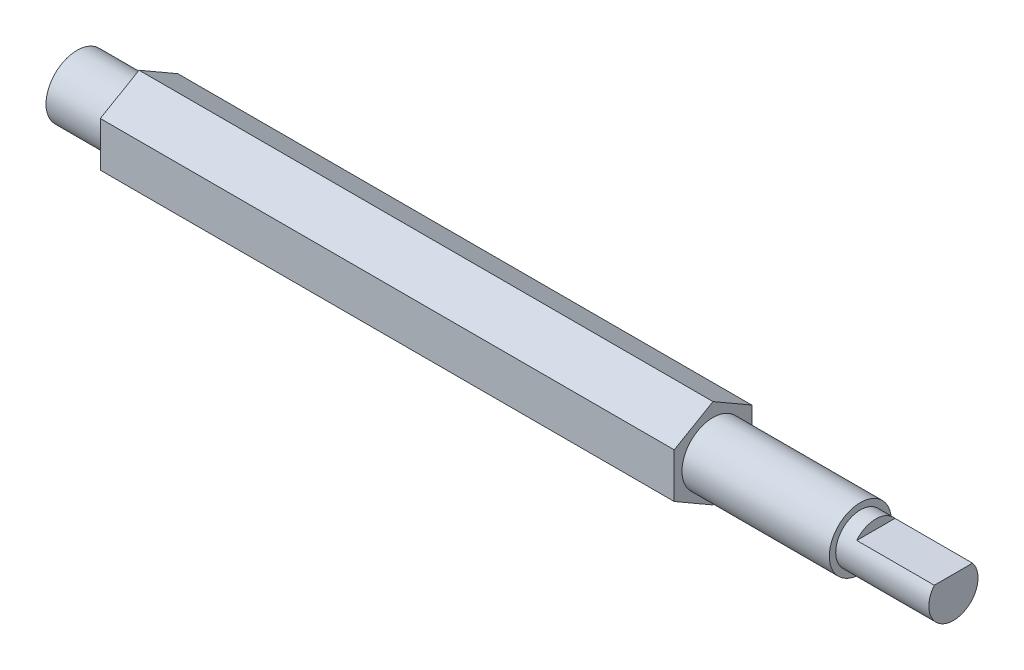
ISO-10303-21;
HEADER;
FILE_DESCRIPTION(('STEP AP214'),'2;1');
FILE_NAME('part.step','',(''),(''),'','','');
FILE_SCHEMA(('AUTOMOTIVE_DESIGN { 1 0 10303 214 1 1 1 1 }'));
ENDSEC;
DATA;
#1=APPLICATION_CONTEXT('core data for automotive mechanical design processes');
#2=APPLICATION_PROTOCOL_DEFINITION('international standard','automotive_design',2000,#1);
#3=PRODUCT_CONTEXT('',#1,'mechanical');
#4=PRODUCT('Part','Part','',(#3));
#5=PRODUCT_RELATED_PRODUCT_CATEGORY('part','',(#4));
#6=PRODUCT_DEFINITION_FORMATION('','',#4);
#7=PRODUCT_DEFINITION_CONTEXT('part definition',#1,'design');
#8=PRODUCT_DEFINITION('design','',#6,#7);
#9=PRODUCT_DEFINITION_SHAPE('','',#8);
#10=(LENGTH_UNIT() NAMED_UNIT(*) SI_UNIT(.MILLI.,.METRE.));
#11=(NAMED_UNIT(*) PLANE_ANGLE_UNIT() SI_UNIT($,.RADIAN.));
#12=(NAMED_UNIT(*) SI_UNIT($,.STERADIAN.) SOLID_ANGLE_UNIT());
#13=UNCERTAINTY_MEASURE_WITH_UNIT(LENGTH_MEASURE(1.E-05),#10,'distance_accuracy_value','');
#14=(GEOMETRIC_REPRESENTATION_CONTEXT(3) GLOBAL_UNCERTAINTY_ASSIGNED_CONTEXT((#13)) GLOBAL_UNIT_ASSIGNED_CONTEXT((#10,
#11,#12)) REPRESENTATION_CONTEXT('',''));
#15=CARTESIAN_POINT('',(0.,0.,0.));
#16=DIRECTION('',(0.,0.,1.));
#17=DIRECTION('',(1.,0.,0.));
#18=AXIS2_PLACEMENT_3D('',#15,#16,#17);
#19=CARTESIAN_POINT('',(36.9999999999998,2.,0.));
#20=DIRECTION('',(-1.,0.,0.));
#21=DIRECTION('',(0.,0.,1.));
#22=AXIS2_PLACEMENT_3D('',#19,#20,#21);
#23=PLANE('',#22);
#24=DIRECTION('',(0.,-0.5,-0.866025403784439));
#25=VECTOR('',#24,1.);
#26=CARTESIAN_POINT('',(36.9999999999998,1.44337567297406,-2.5));
#27=LINE('',#26,#25);
#28=CARTESIAN_POINT('',(36.9999999999998,2.88675134594813,0.));
#29=VERTEX_POINT('',#28);
#30=CARTESIAN_POINT('',(36.9999999999998,1.44337567297406,-2.5));
#31=VERTEX_POINT('',#30);
#32=EDGE_CURVE('E131',#29,#31,#27,.T.);
#33=ORIENTED_EDGE('',*,*,#32,.F.);
#34=DIRECTION('',(0.,0.5,-0.866025403784439));
#35=VECTOR('',#34,1.);
#36=CARTESIAN_POINT('',(36.9999999999998,2.88675134594813,0.));
#37=LINE('',#36,#35);
#38=CARTESIAN_POINT('',(36.9999999999998,1.44337567297406,2.5));
#39=VERTEX_POINT('',#38);
#40=EDGE_CURVE('E129',#39,#29,#37,.T.);
#41=ORIENTED_EDGE('',*,*,#40,.F.);
#42=DIRECTION('',(0.,1.,0.));
#43=VECTOR('',#42,1.);
#44=CARTESIAN_POINT('',(36.9999999999998,1.44337567297406,2.5));
#45=LINE('',#44,#43);
#46=CARTESIAN_POINT('',(36.9999999999998,-1.44337567297406,2.5));
#47=VERTEX_POINT('',#46);
#48=EDGE_CURVE('E61',#47,#39,#45,.T.);
#49=ORIENTED_EDGE('',*,*,#48,.F.);
#50=DIRECTION('',(0.,0.5,0.866025403784439));
#51=VECTOR('',#50,1.);
#52=CARTESIAN_POINT('',(36.9999999999998,-1.44337567297406,2.5));
#53=LINE('',#52,#51);
#54=CARTESIAN_POINT('',(36.9999999999998,-2.88675134594813,0.));
#55=VERTEX_POINT('',#54);
#56=EDGE_CURVE('E125',#55,#47,#53,.T.);
#57=ORIENTED_EDGE('',*,*,#56,.F.);
#58=DIRECTION('',(0.,-0.5,0.866025403784439));
#59=VECTOR('',#58,1.);
#60=CARTESIAN_POINT('',(36.9999999999998,-2.88675134594813,0.));
#61=LINE('',#60,#59);
#62=CARTESIAN_POINT('',(36.9999999999998,-1.44337567297406,-2.5));
#63=VERTEX_POINT('',#62);
#64=EDGE_CURVE('E123',#63,#55,#61,.T.);
#65=ORIENTED_EDGE('',*,*,#64,.F.);
#66=DIRECTION('',(0.,-1.,0.));
#67=VECTOR('',#66,1.);
#68=CARTESIAN_POINT('',(36.9999999999998,-1.44337567297406,-2.5));
#69=LINE('',#68,#67);
#70=EDGE_CURVE('E126',#31,#63,#69,.T.);
#71=ORIENTED_EDGE('',*,*,#70,.F.);
#72=EDGE_LOOP('',(#33,#41,#49,#57,#65,#71));
#73=FACE_BOUND('',#72,.T.);
#74=CARTESIAN_POINT('',(36.9999999999998,0.,0.));
#75=DIRECTION('',(-1.,0.,0.));
#76=DIRECTION('',(0.,0.,1.));
#77=AXIS2_PLACEMENT_3D('',#74,#75,#76);
#78=CIRCLE('',#77,2.);
#79=CARTESIAN_POINT('',(36.9999999999998,0.,2.));
#80=VERTEX_POINT('',#79);
#81=EDGE_CURVE('E178',#80,#80,#78,.T.);
#82=ORIENTED_EDGE('',*,*,#81,.T.);
#83=EDGE_LOOP('',(#82));
#84=FACE_BOUND('',#83,.T.);
#85=ADVANCED_FACE('F38',(#73,#84),#23,.F.);
#86=CARTESIAN_POINT('',(-6.18518518518519,0.,0.));
#87=DIRECTION('',(-1.,0.,0.));
#88=DIRECTION('',(0.,0.,1.));
#89=AXIS2_PLACEMENT_3D('',#86,#87,#88);
#90=CYLINDRICAL_SURFACE('',#89,2.);
#91=ORIENTED_EDGE('',*,*,#81,.F.);
#92=EDGE_LOOP('',(#91));
#93=FACE_BOUND('',#92,.T.);
#94=CARTESIAN_POINT('',(46.4999999999998,0.,0.));
#95=DIRECTION('',(-1.,0.,0.));
#96=DIRECTION('',(0.,0.,1.));
#97=AXIS2_PLACEMENT_3D('',#94,#95,#96);
#98=CIRCLE('',#97,2.);
#99=CARTESIAN_POINT('',(46.4999999999998,0.,2.));
#100=VERTEX_POINT('',#99);
#101=EDGE_CURVE('E175',#100,#100,#98,.T.);
#102=ORIENTED_EDGE('',*,*,#101,.T.);
#103=EDGE_LOOP('',(#102));
#104=FACE_BOUND('',#103,.T.);
#105=ADVANCED_FACE('F197',(#93,#104),#90,.T.);
#106=CARTESIAN_POINT('',(46.4999999999998,2.,0.));
#107=DIRECTION('',(-1.,0.,0.));
#108=DIRECTION('',(0.,0.,1.));
#109=AXIS2_PLACEMENT_3D('',#106,#107,#108);
#110=PLANE('',#109);
#111=ORIENTED_EDGE('',*,*,#101,.F.);
#112=EDGE_LOOP('',(#111));
#113=FACE_BOUND('',#112,.T.);
#114=CARTESIAN_POINT('',(46.4999999999998,0.,0.));
#115=DIRECTION('',(-1.,0.,0.));
#116=DIRECTION('',(0.,0.,1.));
#117=AXIS2_PLACEMENT_3D('',#114,#115,#116);
#118=CIRCLE('',#117,1.5875);
#119=CARTESIAN_POINT('',(46.4999999999998,0.,1.5875));
#120=VERTEX_POINT('',#119);
#121=EDGE_CURVE('E172',#120,#120,#118,.T.);
#122=ORIENTED_EDGE('',*,*,#121,.T.);
#123=EDGE_LOOP('',(#122));
#124=FACE_BOUND('',#123,.T.);
#125=ADVANCED_FACE('F192',(#113,#124),#110,.F.);
#126=CARTESIAN_POINT('',(-6.18518518518519,0.,0.));
#127=DIRECTION('',(-1.,0.,0.));
#128=DIRECTION('',(0.,0.,1.));
#129=AXIS2_PLACEMENT_3D('',#126,#127,#128);
#130=CYLINDRICAL_SURFACE('',#129,1.5875);
#131=ORIENTED_EDGE('',*,*,#121,.F.);
#132=EDGE_LOOP('',(#131));
#133=FACE_BOUND('',#132,.T.);
#134=CARTESIAN_POINT('',(52.4999999999998,0.,0.));
#135=DIRECTION('',(-1.,0.,0.));
#136=DIRECTION('',(0.,0.,1.));
#137=AXIS2_PLACEMENT_3D('',#134,#135,#136);
#138=CIRCLE('',#137,1.5875);
#139=CARTESIAN_POINT('',(52.4999999999998,1.,-1.23294616670802));
#140=VERTEX_POINT('',#139);
#141=CARTESIAN_POINT('',(52.4999999999998,1.,1.23294616670802));
#142=VERTEX_POINT('',#141);
#143=EDGE_CURVE('E116',#140,#142,#138,.T.);
#144=ORIENTED_EDGE('',*,*,#143,.T.);
#145=DIRECTION('',(-1.,0.,0.));
#146=VECTOR('',#145,1.);
#147=CARTESIAN_POINT('',(-6.18518518518519,1.,1.23294616670802));
#148=LINE('',#147,#146);
#149=CARTESIAN_POINT('',(47.4999999999998,1.,1.23294616670802));
#150=VERTEX_POINT('',#149);
#151=EDGE_CURVE('E53',#142,#150,#148,.T.);
#152=ORIENTED_EDGE('',*,*,#151,.T.);
#153=CARTESIAN_POINT('',(47.4999999999998,0.,0.));
#154=DIRECTION('',(1.,0.,0.));
#155=DIRECTION('',(0.,0.,-1.));
#156=AXIS2_PLACEMENT_3D('',#153,#154,#155);
#157=CIRCLE('',#156,1.5875);
#158=CARTESIAN_POINT('',(47.4999999999998,1.,-1.23294616670802));
#159=VERTEX_POINT('',#158);
#160=EDGE_CURVE('E11',#159,#150,#157,.T.);
#161=ORIENTED_EDGE('',*,*,#160,.F.);
#162=DIRECTION('',(-1.,0.,0.));
#163=VECTOR('',#162,1.);
#164=CARTESIAN_POINT('',(-6.18518518518519,1.,-1.23294616670802));
#165=LINE('',#164,#163);
#166=EDGE_CURVE('E103',#159,#140,#165,.F.);
#167=ORIENTED_EDGE('',*,*,#166,.T.);
#168=EDGE_LOOP('',(#144,#152,#161,#167));
#169=FACE_BOUND('',#168,.T.);
#170=ADVANCED_FACE('F115',(#133,#169),#130,.T.);
#171=CARTESIAN_POINT('',(52.4999999999998,1.5875,0.));
#172=DIRECTION('',(-1.,0.,0.));
#173=DIRECTION('',(0.,0.,1.));
#174=AXIS2_PLACEMENT_3D('',#171,#172,#173);
#175=PLANE('',#174);
#176=ORIENTED_EDGE('',*,*,#143,.F.);
#177=DIRECTION('',(0.,0.,1.));
#178=VECTOR('',#177,1.);
#179=CARTESIAN_POINT('',(52.4999999999998,1.,0.));
#180=LINE('',#179,#178);
#181=EDGE_CURVE('E46',#140,#142,#180,.T.);
#182=ORIENTED_EDGE('',*,*,#181,.T.);
#183=EDGE_LOOP('',(#176,#182));
#184=FACE_BOUND('',#183,.T.);
#185=ADVANCED_FACE('F181',(#184),#175,.F.);
#186=CARTESIAN_POINT('',(44.6376261582595,-1.44337567297406,-2.5));
#187=DIRECTION('',(0.,0.,1.));
#188=DIRECTION('',(1.,0.,0.));
#189=AXIS2_PLACEMENT_3D('',#186,#187,#188);
#190=PLANE('',#189);
#191=ORIENTED_EDGE('',*,*,#70,.T.);
#192=DIRECTION('',(-1.,0.,0.));
#193=VECTOR('',#192,1.);
#194=CARTESIAN_POINT('',(44.6376261582595,-1.44337567297406,-2.5));
#195=LINE('',#194,#193);
#196=CARTESIAN_POINT('',(0.,-1.44337567297406,-2.5));
#197=VERTEX_POINT('',#196);
#198=EDGE_CURVE('E151',#63,#197,#195,.T.);
#199=ORIENTED_EDGE('',*,*,#198,.T.);
#200=DIRECTION('',(0.,1.,0.));
#201=VECTOR('',#200,1.);
#202=CARTESIAN_POINT('',(0.,-1.44337567297406,-2.5));
#203=LINE('',#202,#201);
#204=CARTESIAN_POINT('',(0.,1.44337567297406,-2.5));
#205=VERTEX_POINT('',#204);
#206=EDGE_CURVE('E145',#197,#205,#203,.T.);
#207=ORIENTED_EDGE('',*,*,#206,.T.);
#208=DIRECTION('',(-1.,0.,0.));
#209=VECTOR('',#208,1.);
#210=CARTESIAN_POINT('',(44.6376261582595,1.44337567297406,-2.5));
#211=LINE('',#210,#209);
#212=EDGE_CURVE('E148',#31,#205,#211,.T.);
#213=ORIENTED_EDGE('',*,*,#212,.F.);
#214=EDGE_LOOP('',(#191,#199,#207,#213));
#215=FACE_BOUND('',#214,.T.);
#216=ADVANCED_FACE('F183',(#215),#190,.F.);
#217=CARTESIAN_POINT('',(44.6376261582595,-2.88675134594813,0.));
#218=DIRECTION('',(0.,0.866025403784439,0.5));
#219=DIRECTION('',(0.,-0.5,0.866025403784439));
#220=AXIS2_PLACEMENT_3D('',#217,#218,#219);
#221=PLANE('',#220);
#222=ORIENTED_EDGE('',*,*,#64,.T.);
#223=DIRECTION('',(-1.,0.,0.));
#224=VECTOR('',#223,1.);
#225=CARTESIAN_POINT('',(44.6376261582595,-2.88675134594813,0.));
#226=LINE('',#225,#224);
#227=CARTESIAN_POINT('',(0.,-2.88675134594813,0.));
#228=VERTEX_POINT('',#227);
#229=EDGE_CURVE('E154',#55,#228,#226,.T.);
#230=ORIENTED_EDGE('',*,*,#229,.T.);
#231=DIRECTION('',(0.,0.5,-0.866025403784439));
#232=VECTOR('',#231,1.);
#233=CARTESIAN_POINT('',(0.,-2.88675134594813,0.));
#234=LINE('',#233,#232);
#235=EDGE_CURVE('E142',#228,#197,#234,.T.);
#236=ORIENTED_EDGE('',*,*,#235,.T.);
#237=ORIENTED_EDGE('',*,*,#198,.F.);
#238=EDGE_LOOP('',(#222,#230,#236,#237));
#239=FACE_BOUND('',#238,.T.);
#240=ADVANCED_FACE('F189',(#239),#221,.F.);
#241=CARTESIAN_POINT('',(44.6376261582595,-1.44337567297406,2.5));
#242=DIRECTION('',(0.,0.866025403784439,-0.5));
#243=DIRECTION('',(0.,0.5,0.866025403784439));
#244=AXIS2_PLACEMENT_3D('',#241,#242,#243);
#245=PLANE('',#244);
#246=ORIENTED_EDGE('',*,*,#56,.T.);
#247=DIRECTION('',(-1.,0.,0.));
#248=VECTOR('',#247,1.);
#249=CARTESIAN_POINT('',(44.6376261582595,-1.44337567297406,2.5));
#250=LINE('',#249,#248);
#251=CARTESIAN_POINT('',(0.,-1.44337567297406,2.5));
#252=VERTEX_POINT('',#251);
#253=EDGE_CURVE('E157',#47,#252,#250,.T.);
#254=ORIENTED_EDGE('',*,*,#253,.T.);
#255=DIRECTION('',(0.,-0.5,-0.866025403784439));
#256=VECTOR('',#255,1.);
#257=CARTESIAN_POINT('',(0.,-1.44337567297406,2.5));
#258=LINE('',#257,#256);
#259=EDGE_CURVE('E139',#252,#228,#258,.T.);
#260=ORIENTED_EDGE('',*,*,#259,.T.);
#261=ORIENTED_EDGE('',*,*,#229,.F.);
#262=EDGE_LOOP('',(#246,#254,#260,#261));
#263=FACE_BOUND('',#262,.T.);
#264=ADVANCED_FACE('F284',(#263),#245,.F.);
#265=CARTESIAN_POINT('',(44.6376261582595,1.44337567297406,2.5));
#266=DIRECTION('',(0.,0.,-1.));
#267=DIRECTION('',(0.,1.,0.));
#268=AXIS2_PLACEMENT_3D('',#265,#266,#267);
#269=PLANE('',#268);
#270=ORIENTED_EDGE('',*,*,#48,.T.);
#271=DIRECTION('',(-1.,0.,0.));
#272=VECTOR('',#271,1.);
#273=CARTESIAN_POINT('',(44.6376261582595,1.44337567297406,2.5));
#274=LINE('',#273,#272);
#275=CARTESIAN_POINT('',(0.,1.44337567297406,2.5));
#276=VERTEX_POINT('',#275);
#277=EDGE_CURVE('E160',#39,#276,#274,.T.);
#278=ORIENTED_EDGE('',*,*,#277,.T.);
#279=DIRECTION('',(0.,-1.,0.));
#280=VECTOR('',#279,1.);
#281=CARTESIAN_POINT('',(0.,1.44337567297406,2.5));
#282=LINE('',#281,#280);
#283=EDGE_CURVE('E136',#276,#252,#282,.T.);
#284=ORIENTED_EDGE('',*,*,#283,.T.);
#285=ORIENTED_EDGE('',*,*,#253,.F.);
#286=EDGE_LOOP('',(#270,#278,#284,#285));
#287=FACE_BOUND('',#286,.T.);
#288=ADVANCED_FACE('F274',(#287),#269,.F.);
#289=CARTESIAN_POINT('',(44.6376261582595,2.88675134594813,0.));
#290=DIRECTION('',(0.,-0.866025403784439,-0.5));
#291=DIRECTION('',(0.,0.5,-0.866025403784439));
#292=AXIS2_PLACEMENT_3D('',#289,#290,#291);
#293=PLANE('',#292);
#294=ORIENTED_EDGE('',*,*,#40,.T.);
#295=DIRECTION('',(-1.,0.,0.));
#296=VECTOR('',#295,1.);
#297=CARTESIAN_POINT('',(44.6376261582595,2.88675134594813,0.));
#298=LINE('',#297,#296);
#299=CARTESIAN_POINT('',(0.,2.88675134594813,0.));
#300=VERTEX_POINT('',#299);
#301=EDGE_CURVE('E162',#29,#300,#298,.T.);
#302=ORIENTED_EDGE('',*,*,#301,.T.);
#303=DIRECTION('',(0.,-0.5,0.866025403784439));
#304=VECTOR('',#303,1.);
#305=CARTESIAN_POINT('',(0.,2.88675134594813,0.));
#306=LINE('',#305,#304);
#307=EDGE_CURVE('E120',#300,#276,#306,.T.);
#308=ORIENTED_EDGE('',*,*,#307,.T.);
#309=ORIENTED_EDGE('',*,*,#277,.F.);
#310=EDGE_LOOP('',(#294,#302,#308,#309));
#311=FACE_BOUND('',#310,.T.);
#312=ADVANCED_FACE('F265',(#311),#293,.F.);
#313=CARTESIAN_POINT('',(44.6376261582595,1.44337567297406,-2.5));
#314=DIRECTION('',(0.,-0.866025403784439,0.5));
#315=DIRECTION('',(0.,-0.5,-0.866025403784439));
#316=AXIS2_PLACEMENT_3D('',#313,#314,#315);
#317=PLANE('',#316);
#318=ORIENTED_EDGE('',*,*,#32,.T.);
#319=ORIENTED_EDGE('',*,*,#212,.T.);
#320=DIRECTION('',(0.,0.5,0.866025403784439));
#321=VECTOR('',#320,1.);
#322=CARTESIAN_POINT('',(0.,1.44337567297406,-2.5));
#323=LINE('',#322,#321);
#324=EDGE_CURVE('E117',#205,#300,#323,.T.);
#325=ORIENTED_EDGE('',*,*,#324,.T.);
#326=ORIENTED_EDGE('',*,*,#301,.F.);
#327=EDGE_LOOP('',(#318,#319,#325,#326));
#328=FACE_BOUND('',#327,.T.);
#329=ADVANCED_FACE('F259',(#328),#317,.F.);
#330=CARTESIAN_POINT('',(-4.,2.,0.));
#331=DIRECTION('',(1.,0.,0.));
#332=DIRECTION('',(0.,0.,-1.));
#333=AXIS2_PLACEMENT_3D('',#330,#331,#332);
#334=PLANE('',#333);
#335=CARTESIAN_POINT('',(-4.,0.,0.));
#336=DIRECTION('',(-1.,0.,0.));
#337=DIRECTION('',(0.,0.,1.));
#338=AXIS2_PLACEMENT_3D('',#335,#336,#337);
#339=CIRCLE('',#338,2.);
#340=CARTESIAN_POINT('',(-4.,0.,2.));
#341=VERTEX_POINT('',#340);
#342=EDGE_CURVE('E168',#341,#341,#339,.T.);
#343=ORIENTED_EDGE('',*,*,#342,.T.);
#344=EDGE_LOOP('',(#343));
#345=FACE_BOUND('',#344,.T.);
#346=ADVANCED_FACE('F264',(#345),#334,.F.);
#347=CARTESIAN_POINT('',(-6.18518518518519,0.,0.));
#348=DIRECTION('',(-1.,0.,0.));
#349=DIRECTION('',(0.,0.,1.));
#350=AXIS2_PLACEMENT_3D('',#347,#348,#349);
#351=CYLINDRICAL_SURFACE('',#350,2.);
#352=ORIENTED_EDGE('',*,*,#342,.F.);
#353=EDGE_LOOP('',(#352));
#354=FACE_BOUND('',#353,.T.);
#355=CARTESIAN_POINT('',(0.,0.,0.));
#356=DIRECTION('',(-1.,0.,0.));
#357=DIRECTION('',(0.,0.,1.));
#358=AXIS2_PLACEMENT_3D('',#355,#356,#357);
#359=CIRCLE('',#358,2.);
#360=CARTESIAN_POINT('',(0.,0.,2.));
#361=VERTEX_POINT('',#360);
#362=EDGE_CURVE('E132',#361,#361,#359,.T.);
#363=ORIENTED_EDGE('',*,*,#362,.T.);
#364=EDGE_LOOP('',(#363));
#365=FACE_BOUND('',#364,.T.);
#366=ADVANCED_FACE('F314',(#354,#365),#351,.T.);
#367=CARTESIAN_POINT('',(0.,2.5,0.));
#368=DIRECTION('',(1.,0.,0.));
#369=DIRECTION('',(0.,0.,-1.));
#370=AXIS2_PLACEMENT_3D('',#367,#368,#369);
#371=PLANE('',#370);
#372=ORIENTED_EDGE('',*,*,#362,.F.);
#373=EDGE_LOOP('',(#372));
#374=FACE_BOUND('',#373,.T.);
#375=ORIENTED_EDGE('',*,*,#283,.F.);
#376=ORIENTED_EDGE('',*,*,#307,.F.);
#377=ORIENTED_EDGE('',*,*,#324,.F.);
#378=ORIENTED_EDGE('',*,*,#206,.F.);
#379=ORIENTED_EDGE('',*,*,#235,.F.);
#380=ORIENTED_EDGE('',*,*,#259,.F.);
#381=EDGE_LOOP('',(#375,#376,#377,#378,#379,#380));
#382=FACE_BOUND('',#381,.T.);
#383=ADVANCED_FACE('F40',(#374,#382),#371,.F.);
#384=CARTESIAN_POINT('',(47.4999999999998,2.88675134594813,-5.32078830754921));
#385=DIRECTION('',(1.,0.,0.));
#386=DIRECTION('',(0.,0.,-1.));
#387=AXIS2_PLACEMENT_3D('',#384,#385,#386);
#388=PLANE('',#387);
#389=ORIENTED_EDGE('',*,*,#160,.T.);
#390=DIRECTION('',(0.,0.,1.));
#391=VECTOR('',#390,1.);
#392=CARTESIAN_POINT('',(47.4999999999998,1.,-5.32078830754921));
#393=LINE('',#392,#391);
#394=EDGE_CURVE('E106',#159,#150,#393,.T.);
#395=ORIENTED_EDGE('',*,*,#394,.F.);
#396=EDGE_LOOP('',(#389,#395));
#397=FACE_BOUND('',#396,.T.);
#398=ADVANCED_FACE('F113',(#397),#388,.T.);
#399=CARTESIAN_POINT('',(0.,1.,0.));
#400=DIRECTION('',(0.,-1.,0.));
#401=DIRECTION('',(0.,0.,-1.));
#402=AXIS2_PLACEMENT_3D('',#399,#400,#401);
#403=PLANE('',#402);
#404=ORIENTED_EDGE('',*,*,#181,.F.);
#405=ORIENTED_EDGE('',*,*,#166,.F.);
#406=ORIENTED_EDGE('',*,*,#394,.T.);
#407=ORIENTED_EDGE('',*,*,#151,.F.);
#408=EDGE_LOOP('',(#404,#405,#406,#407));
#409=FACE_BOUND('',#408,.T.);
#410=ADVANCED_FACE('F105',(#409),#403,.F.);
#411=CLOSED_SHELL('',(#85,#105,#125,#170,#185,#216,#240,#264,#288,#312,#329,#346,#366,#383,#398,#410));
#412=MANIFOLD_SOLID_BREP('B2',#411);
#413=ADVANCED_BREP_SHAPE_REPRESENTATION('',(#18,#412),#14);
#414=SHAPE_DEFINITION_REPRESENTATION(#9,#413);
ENDSEC;
END-ISO-10303-21;
